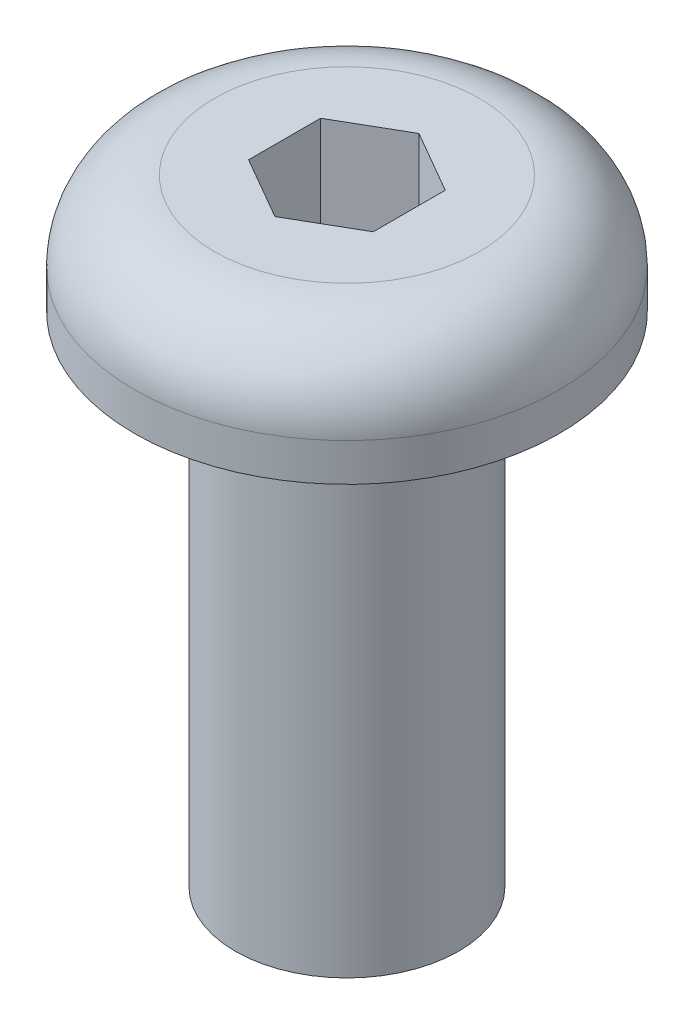
ISO-10303-21;
HEADER;
FILE_DESCRIPTION(('STEP AP214'),'2;1');
FILE_NAME('part.step','',(''),(''),'','','');
FILE_SCHEMA(('AUTOMOTIVE_DESIGN { 1 0 10303 214 1 1 1 1 }'));
ENDSEC;
DATA;
#1=APPLICATION_CONTEXT('core data for automotive mechanical design processes');
#2=APPLICATION_PROTOCOL_DEFINITION('international standard','automotive_design',2000,#1);
#3=PRODUCT_CONTEXT('',#1,'mechanical');
#4=PRODUCT('Part','Part','',(#3));
#5=PRODUCT_RELATED_PRODUCT_CATEGORY('part','',(#4));
#6=PRODUCT_DEFINITION_FORMATION('','',#4);
#7=PRODUCT_DEFINITION_CONTEXT('part definition',#1,'design');
#8=PRODUCT_DEFINITION('design','',#6,#7);
#9=PRODUCT_DEFINITION_SHAPE('','',#8);
#10=(LENGTH_UNIT() NAMED_UNIT(*) SI_UNIT(.MILLI.,.METRE.));
#11=(NAMED_UNIT(*) PLANE_ANGLE_UNIT() SI_UNIT($,.RADIAN.));
#12=(NAMED_UNIT(*) SI_UNIT($,.STERADIAN.) SOLID_ANGLE_UNIT());
#13=UNCERTAINTY_MEASURE_WITH_UNIT(LENGTH_MEASURE(1.E-05),#10,'distance_accuracy_value','');
#14=(GEOMETRIC_REPRESENTATION_CONTEXT(3) GLOBAL_UNCERTAINTY_ASSIGNED_CONTEXT((#13)) GLOBAL_UNIT_ASSIGNED_CONTEXT((#10,
#11,#12)) REPRESENTATION_CONTEXT('',''));
#15=CARTESIAN_POINT('',(0.,0.,0.));
#16=DIRECTION('',(0.,0.,1.));
#17=DIRECTION('',(1.,0.,0.));
#18=AXIS2_PLACEMENT_3D('',#15,#16,#17);
#19=CARTESIAN_POINT('',(0.,6.35,0.));
#20=DIRECTION('',(0.,-1.,0.));
#21=DIRECTION('',(0.,0.,-1.));
#22=AXIS2_PLACEMENT_3D('',#19,#20,#21);
#23=CYLINDRICAL_SURFACE('',#22,1.4224);
#24=CARTESIAN_POINT('',(0.,6.35,0.));
#25=DIRECTION('',(0.,1.,0.));
#26=DIRECTION('',(0.,0.,1.));
#27=AXIS2_PLACEMENT_3D('',#24,#25,#26);
#28=CIRCLE('',#27,1.4224);
#29=CARTESIAN_POINT('',(0.,6.35,1.4224));
#30=VERTEX_POINT('',#29);
#31=EDGE_CURVE('E141',#30,#30,#28,.T.);
#32=ORIENTED_EDGE('',*,*,#31,.F.);
#33=EDGE_LOOP('',(#32));
#34=FACE_BOUND('',#33,.T.);
#35=CARTESIAN_POINT('',(0.,0.,0.));
#36=DIRECTION('',(0.,1.,0.));
#37=DIRECTION('',(0.,0.,1.));
#38=AXIS2_PLACEMENT_3D('',#35,#36,#37);
#39=CIRCLE('',#38,1.4224);
#40=CARTESIAN_POINT('',(0.,0.,1.4224));
#41=VERTEX_POINT('',#40);
#42=EDGE_CURVE('E140',#41,#41,#39,.T.);
#43=ORIENTED_EDGE('',*,*,#42,.T.);
#44=EDGE_LOOP('',(#43));
#45=FACE_BOUND('',#44,.T.);
#46=ADVANCED_FACE('F30',(#34,#45),#23,.T.);
#47=CARTESIAN_POINT('',(0.,0.,0.));
#48=DIRECTION('',(0.,1.,0.));
#49=DIRECTION('',(0.,0.,1.));
#50=AXIS2_PLACEMENT_3D('',#47,#48,#49);
#51=PLANE('',#50);
#52=ORIENTED_EDGE('',*,*,#42,.F.);
#53=EDGE_LOOP('',(#52));
#54=FACE_BOUND('',#53,.T.);
#55=ADVANCED_FACE('F164',(#54),#51,.F.);
#56=CARTESIAN_POINT('',(0.,6.35,0.));
#57=DIRECTION('',(0.,1.,0.));
#58=DIRECTION('',(0.,0.,1.));
#59=AXIS2_PLACEMENT_3D('',#56,#57,#58);
#60=PLANE('',#59);
#61=CARTESIAN_POINT('',(0.,6.35,0.));
#62=DIRECTION('',(0.,1.,0.));
#63=DIRECTION('',(0.,0.,1.));
#64=AXIS2_PLACEMENT_3D('',#61,#62,#63);
#65=CIRCLE('',#64,2.7051);
#66=CARTESIAN_POINT('',(0.,6.35,2.7051));
#67=VERTEX_POINT('',#66);
#68=EDGE_CURVE('E132',#67,#67,#65,.T.);
#69=ORIENTED_EDGE('',*,*,#68,.F.);
#70=EDGE_LOOP('',(#69));
#71=FACE_BOUND('',#70,.T.);
#72=ORIENTED_EDGE('',*,*,#31,.T.);
#73=EDGE_LOOP('',(#72));
#74=FACE_BOUND('',#73,.T.);
#75=ADVANCED_FACE('F169',(#71,#74),#60,.F.);
#76=CARTESIAN_POINT('',(0.,7.8486,0.));
#77=DIRECTION('',(0.,-1.,0.));
#78=DIRECTION('',(0.,0.,-1.));
#79=AXIS2_PLACEMENT_3D('',#76,#77,#78);
#80=CYLINDRICAL_SURFACE('',#79,2.7051);
#81=CARTESIAN_POINT('',(0.,6.8326,0.));
#82=DIRECTION('',(0.,1.,0.));
#83=DIRECTION('',(0.,0.,1.));
#84=AXIS2_PLACEMENT_3D('',#81,#82,#83);
#85=CIRCLE('',#84,2.7051);
#86=CARTESIAN_POINT('',(0.,6.8326,2.7051));
#87=VERTEX_POINT('',#86);
#88=EDGE_CURVE('E11',#87,#87,#85,.F.);
#89=ORIENTED_EDGE('',*,*,#88,.T.);
#90=EDGE_LOOP('',(#89));
#91=FACE_BOUND('',#90,.T.);
#92=ORIENTED_EDGE('',*,*,#68,.T.);
#93=EDGE_LOOP('',(#92));
#94=FACE_BOUND('',#93,.T.);
#95=ADVANCED_FACE('F159',(#91,#94),#80,.T.);
#96=CARTESIAN_POINT('',(0.,7.8486,0.));
#97=DIRECTION('',(0.,1.,0.));
#98=DIRECTION('',(0.,0.,1.));
#99=AXIS2_PLACEMENT_3D('',#96,#97,#98);
#100=PLANE('',#99);
#101=DIRECTION('',(-0.866025403784438,0.,-0.5));
#102=VECTOR('',#101,1.);
#103=CARTESIAN_POINT('',(0.79375,7.8486,-0.458271776169266));
#104=LINE('',#103,#102);
#105=CARTESIAN_POINT('',(0.79375,7.8486,-0.458271776169266));
#106=VERTEX_POINT('',#105);
#107=CARTESIAN_POINT('',(0.,7.8486,-0.916543552338531));
#108=VERTEX_POINT('',#107);
#109=EDGE_CURVE('E45',#106,#108,#104,.T.);
#110=ORIENTED_EDGE('',*,*,#109,.F.);
#111=DIRECTION('',(0.,0.,-1.));
#112=VECTOR('',#111,1.);
#113=CARTESIAN_POINT('',(0.79375,7.8486,0.458271776169266));
#114=LINE('',#113,#112);
#115=CARTESIAN_POINT('',(0.79375,7.8486,0.458271776169266));
#116=VERTEX_POINT('',#115);
#117=EDGE_CURVE('E128',#116,#106,#114,.T.);
#118=ORIENTED_EDGE('',*,*,#117,.F.);
#119=DIRECTION('',(0.866025403784439,0.,-0.5));
#120=VECTOR('',#119,1.);
#121=CARTESIAN_POINT('',(0.,7.8486,0.916543552338531));
#122=LINE('',#121,#120);
#123=CARTESIAN_POINT('',(0.,7.8486,0.916543552338531));
#124=VERTEX_POINT('',#123);
#125=EDGE_CURVE('E126',#124,#116,#122,.T.);
#126=ORIENTED_EDGE('',*,*,#125,.F.);
#127=DIRECTION('',(0.866025403784439,0.,0.5));
#128=VECTOR('',#127,1.);
#129=CARTESIAN_POINT('',(-0.79375,7.8486,0.458271776169265));
#130=LINE('',#129,#128);
#131=CARTESIAN_POINT('',(-0.79375,7.8486,0.458271776169265));
#132=VERTEX_POINT('',#131);
#133=EDGE_CURVE('E93',#132,#124,#130,.T.);
#134=ORIENTED_EDGE('',*,*,#133,.F.);
#135=DIRECTION('',(0.,0.,1.));
#136=VECTOR('',#135,1.);
#137=CARTESIAN_POINT('',(-0.79375,7.8486,-0.458271776169265));
#138=LINE('',#137,#136);
#139=CARTESIAN_POINT('',(-0.79375,7.8486,-0.458271776169265));
#140=VERTEX_POINT('',#139);
#141=EDGE_CURVE('E122',#140,#132,#138,.T.);
#142=ORIENTED_EDGE('',*,*,#141,.F.);
#143=DIRECTION('',(-0.866025403784438,0.,0.5));
#144=VECTOR('',#143,1.);
#145=CARTESIAN_POINT('',(0.,7.8486,-0.916543552338531));
#146=LINE('',#145,#144);
#147=EDGE_CURVE('E119',#108,#140,#146,.T.);
#148=ORIENTED_EDGE('',*,*,#147,.F.);
#149=EDGE_LOOP('',(#110,#118,#126,#134,#142,#148));
#150=FACE_BOUND('',#149,.T.);
#151=CARTESIAN_POINT('',(0.,7.8486,0.));
#152=DIRECTION('',(0.,1.,0.));
#153=DIRECTION('',(0.,0.,1.));
#154=AXIS2_PLACEMENT_3D('',#151,#152,#153);
#155=CIRCLE('',#154,1.6891);
#156=CARTESIAN_POINT('',(0.,7.8486,1.6891));
#157=VERTEX_POINT('',#156);
#158=EDGE_CURVE('E38',#157,#157,#155,.T.);
#159=ORIENTED_EDGE('',*,*,#158,.T.);
#160=EDGE_LOOP('',(#159));
#161=FACE_BOUND('',#160,.T.);
#162=ADVANCED_FACE('F148',(#150,#161),#100,.T.);
#163=CARTESIAN_POINT('',(0.,6.8326,0.));
#164=DIRECTION('',(0.,1.,0.));
#165=DIRECTION('',(0.,0.,1.));
#166=AXIS2_PLACEMENT_3D('',#163,#164,#165);
#167=TOROIDAL_SURFACE('',#166,1.6891,1.016);
#168=ORIENTED_EDGE('',*,*,#88,.F.);
#169=EDGE_LOOP('',(#168));
#170=FACE_BOUND('',#169,.T.);
#171=ORIENTED_EDGE('',*,*,#158,.F.);
#172=EDGE_LOOP('',(#171));
#173=FACE_BOUND('',#172,.T.);
#174=ADVANCED_FACE('F32',(#170,#173),#167,.T.);
#175=CARTESIAN_POINT('',(0.79375,5.46735,-0.458271776169266));
#176=DIRECTION('',(0.5,0.,-0.866025403784439));
#177=DIRECTION('',(-0.866025403784438,0.,-0.5));
#178=AXIS2_PLACEMENT_3D('',#175,#176,#177);
#179=PLANE('',#178);
#180=ORIENTED_EDGE('',*,*,#109,.T.);
#181=DIRECTION('',(0.,1.,0.));
#182=VECTOR('',#181,1.);
#183=CARTESIAN_POINT('',(0.,5.46735,-0.916543552338531));
#184=LINE('',#183,#182);
#185=CARTESIAN_POINT('',(0.,5.46735,-0.916543552338531));
#186=VERTEX_POINT('',#185);
#187=EDGE_CURVE('E75',#186,#108,#184,.T.);
#188=ORIENTED_EDGE('',*,*,#187,.F.);
#189=DIRECTION('',(-0.866025403784438,0.,-0.5));
#190=VECTOR('',#189,1.);
#191=CARTESIAN_POINT('',(0.79375,5.46735,-0.458271776169266));
#192=LINE('',#191,#190);
#193=CARTESIAN_POINT('',(0.79375,5.46735,-0.458271776169266));
#194=VERTEX_POINT('',#193);
#195=EDGE_CURVE('E130',#194,#186,#192,.T.);
#196=ORIENTED_EDGE('',*,*,#195,.F.);
#197=DIRECTION('',(0.,1.,0.));
#198=VECTOR('',#197,1.);
#199=CARTESIAN_POINT('',(0.79375,5.46735,-0.458271776169266));
#200=LINE('',#199,#198);
#201=EDGE_CURVE('E53',#194,#106,#200,.T.);
#202=ORIENTED_EDGE('',*,*,#201,.T.);
#203=EDGE_LOOP('',(#180,#188,#196,#202));
#204=FACE_BOUND('',#203,.T.);
#205=ADVANCED_FACE('F151',(#204),#179,.F.);
#206=CARTESIAN_POINT('',(0.79375,5.46735,0.458271776169266));
#207=DIRECTION('',(1.,0.,0.));
#208=DIRECTION('',(0.,0.,-1.));
#209=AXIS2_PLACEMENT_3D('',#206,#207,#208);
#210=PLANE('',#209);
#211=ORIENTED_EDGE('',*,*,#117,.T.);
#212=ORIENTED_EDGE('',*,*,#201,.F.);
#213=DIRECTION('',(0.,0.,-1.));
#214=VECTOR('',#213,1.);
#215=CARTESIAN_POINT('',(0.79375,5.46735,0.458271776169266));
#216=LINE('',#215,#214);
#217=CARTESIAN_POINT('',(0.79375,5.46735,0.458271776169266));
#218=VERTEX_POINT('',#217);
#219=EDGE_CURVE('E105',#218,#194,#216,.T.);
#220=ORIENTED_EDGE('',*,*,#219,.F.);
#221=DIRECTION('',(0.,1.,0.));
#222=VECTOR('',#221,1.);
#223=CARTESIAN_POINT('',(0.79375,5.46735,0.458271776169266));
#224=LINE('',#223,#222);
#225=EDGE_CURVE('E97',#218,#116,#224,.T.);
#226=ORIENTED_EDGE('',*,*,#225,.T.);
#227=EDGE_LOOP('',(#211,#212,#220,#226));
#228=FACE_BOUND('',#227,.T.);
#229=ADVANCED_FACE('F157',(#228),#210,.F.);
#230=CARTESIAN_POINT('',(0.,5.46735,0.916543552338531));
#231=DIRECTION('',(0.5,0.,0.866025403784439));
#232=DIRECTION('',(0.866025403784439,0.,-0.5));
#233=AXIS2_PLACEMENT_3D('',#230,#231,#232);
#234=PLANE('',#233);
#235=ORIENTED_EDGE('',*,*,#125,.T.);
#236=ORIENTED_EDGE('',*,*,#225,.F.);
#237=DIRECTION('',(0.866025403784439,0.,-0.5));
#238=VECTOR('',#237,1.);
#239=CARTESIAN_POINT('',(0.,5.46735,0.916543552338531));
#240=LINE('',#239,#238);
#241=CARTESIAN_POINT('',(0.,5.46735,0.916543552338531));
#242=VERTEX_POINT('',#241);
#243=EDGE_CURVE('E101',#242,#218,#240,.T.);
#244=ORIENTED_EDGE('',*,*,#243,.F.);
#245=DIRECTION('',(0.,1.,0.));
#246=VECTOR('',#245,1.);
#247=CARTESIAN_POINT('',(0.,5.46735,0.916543552338531));
#248=LINE('',#247,#246);
#249=EDGE_CURVE('E86',#242,#124,#248,.T.);
#250=ORIENTED_EDGE('',*,*,#249,.T.);
#251=EDGE_LOOP('',(#235,#236,#244,#250));
#252=FACE_BOUND('',#251,.T.);
#253=ADVANCED_FACE('F102',(#252),#234,.F.);
#254=CARTESIAN_POINT('',(-0.79375,5.46735,0.458271776169265));
#255=DIRECTION('',(-0.5,0.,0.866025403784439));
#256=DIRECTION('',(0.866025403784438,0.,0.5));
#257=AXIS2_PLACEMENT_3D('',#254,#255,#256);
#258=PLANE('',#257);
#259=ORIENTED_EDGE('',*,*,#133,.T.);
#260=ORIENTED_EDGE('',*,*,#249,.F.);
#261=DIRECTION('',(0.866025403784439,0.,0.5));
#262=VECTOR('',#261,1.);
#263=CARTESIAN_POINT('',(-0.79375,5.46735,0.458271776169265));
#264=LINE('',#263,#262);
#265=CARTESIAN_POINT('',(-0.79375,5.46735,0.458271776169265));
#266=VERTEX_POINT('',#265);
#267=EDGE_CURVE('E90',#266,#242,#264,.T.);
#268=ORIENTED_EDGE('',*,*,#267,.F.);
#269=DIRECTION('',(0.,1.,0.));
#270=VECTOR('',#269,1.);
#271=CARTESIAN_POINT('',(-0.79375,5.46735,0.458271776169265));
#272=LINE('',#271,#270);
#273=EDGE_CURVE('E98',#266,#132,#272,.T.);
#274=ORIENTED_EDGE('',*,*,#273,.T.);
#275=EDGE_LOOP('',(#259,#260,#268,#274));
#276=FACE_BOUND('',#275,.T.);
#277=ADVANCED_FACE('F88',(#276),#258,.F.);
#278=CARTESIAN_POINT('',(-0.79375,5.46735,-0.458271776169265));
#279=DIRECTION('',(-1.,0.,0.));
#280=DIRECTION('',(0.,0.,1.));
#281=AXIS2_PLACEMENT_3D('',#278,#279,#280);
#282=PLANE('',#281);
#283=ORIENTED_EDGE('',*,*,#141,.T.);
#284=ORIENTED_EDGE('',*,*,#273,.F.);
#285=DIRECTION('',(0.,0.,1.));
#286=VECTOR('',#285,1.);
#287=CARTESIAN_POINT('',(-0.79375,5.46735,-0.458271776169265));
#288=LINE('',#287,#286);
#289=CARTESIAN_POINT('',(-0.79375,5.46735,-0.458271776169265));
#290=VERTEX_POINT('',#289);
#291=EDGE_CURVE('E111',#290,#266,#288,.T.);
#292=ORIENTED_EDGE('',*,*,#291,.F.);
#293=DIRECTION('',(0.,1.,0.));
#294=VECTOR('',#293,1.);
#295=CARTESIAN_POINT('',(-0.79375,5.46735,-0.458271776169265));
#296=LINE('',#295,#294);
#297=EDGE_CURVE('E135',#290,#140,#296,.T.);
#298=ORIENTED_EDGE('',*,*,#297,.T.);
#299=EDGE_LOOP('',(#283,#284,#292,#298));
#300=FACE_BOUND('',#299,.T.);
#301=ADVANCED_FACE('F184',(#300),#282,.F.);
#302=CARTESIAN_POINT('',(0.,5.46735,-0.916543552338531));
#303=DIRECTION('',(-0.5,0.,-0.866025403784439));
#304=DIRECTION('',(-0.866025403784438,0.,0.5));
#305=AXIS2_PLACEMENT_3D('',#302,#303,#304);
#306=PLANE('',#305);
#307=ORIENTED_EDGE('',*,*,#147,.T.);
#308=ORIENTED_EDGE('',*,*,#297,.F.);
#309=DIRECTION('',(-0.866025403784438,0.,0.5));
#310=VECTOR('',#309,1.);
#311=CARTESIAN_POINT('',(0.,5.46735,-0.916543552338531));
#312=LINE('',#311,#310);
#313=EDGE_CURVE('E113',#186,#290,#312,.T.);
#314=ORIENTED_EDGE('',*,*,#313,.F.);
#315=ORIENTED_EDGE('',*,*,#187,.T.);
#316=EDGE_LOOP('',(#307,#308,#314,#315));
#317=FACE_BOUND('',#316,.T.);
#318=ADVANCED_FACE('F181',(#317),#306,.F.);
#319=CARTESIAN_POINT('',(0.,5.46735,-0.916543552338531));
#320=DIRECTION('',(0.,1.,0.));
#321=DIRECTION('',(0.,0.,1.));
#322=AXIS2_PLACEMENT_3D('',#319,#320,#321);
#323=PLANE('',#322);
#324=ORIENTED_EDGE('',*,*,#195,.T.);
#325=ORIENTED_EDGE('',*,*,#313,.T.);
#326=ORIENTED_EDGE('',*,*,#291,.T.);
#327=ORIENTED_EDGE('',*,*,#267,.T.);
#328=ORIENTED_EDGE('',*,*,#243,.T.);
#329=ORIENTED_EDGE('',*,*,#219,.T.);
#330=EDGE_LOOP('',(#324,#325,#326,#327,#328,#329));
#331=FACE_BOUND('',#330,.T.);
#332=ADVANCED_FACE('F108',(#331),#323,.T.);
#333=CLOSED_SHELL('',(#46,#55,#75,#95,#162,#174,#205,#229,#253,#277,#301,#318,#332));
#334=MANIFOLD_SOLID_BREP('B2',#333);
#335=ADVANCED_BREP_SHAPE_REPRESENTATION('',(#18,#334),#14);
#336=SHAPE_DEFINITION_REPRESENTATION(#9,#335);
ENDSEC;
END-ISO-10303-21;
